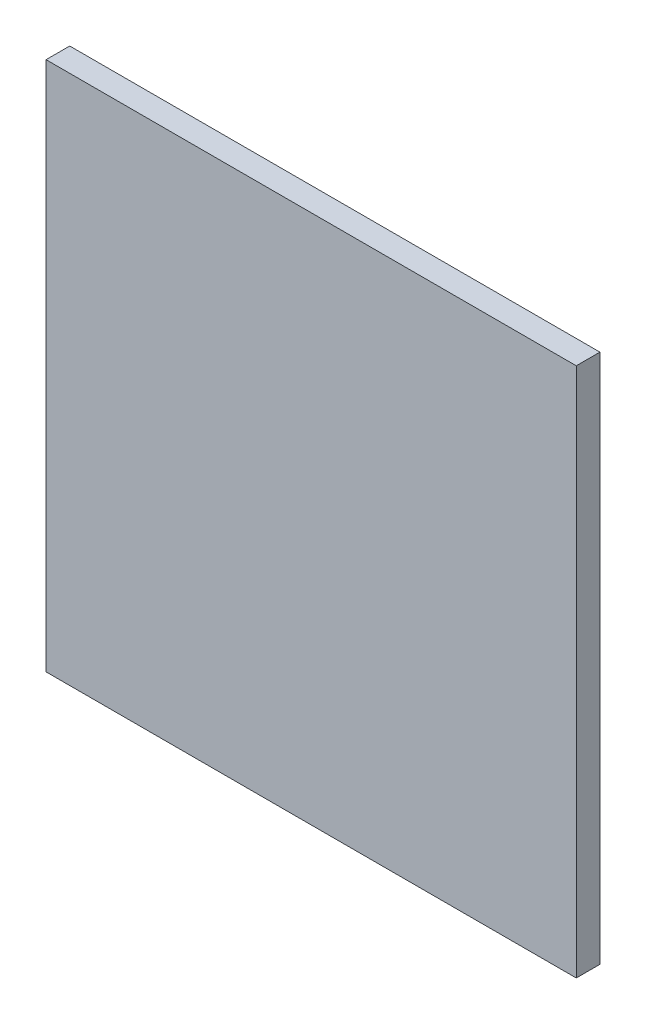
ISO-10303-21;
HEADER;
FILE_DESCRIPTION(('STEP AP214'),'2;1');
FILE_NAME('part.step','',(''),(''),'','','');
FILE_SCHEMA(('AUTOMOTIVE_DESIGN { 1 0 10303 214 1 1 1 1 }'));
ENDSEC;
DATA;
#1=APPLICATION_CONTEXT('core data for automotive mechanical design processes');
#2=APPLICATION_PROTOCOL_DEFINITION('international standard','automotive_design',2000,#1);
#3=PRODUCT_CONTEXT('',#1,'mechanical');
#4=PRODUCT('Part','Part','',(#3));
#5=PRODUCT_RELATED_PRODUCT_CATEGORY('part','',(#4));
#6=PRODUCT_DEFINITION_FORMATION('','',#4);
#7=PRODUCT_DEFINITION_CONTEXT('part definition',#1,'design');
#8=PRODUCT_DEFINITION('design','',#6,#7);
#9=PRODUCT_DEFINITION_SHAPE('','',#8);
#10=(LENGTH_UNIT() NAMED_UNIT(*) SI_UNIT(.MILLI.,.METRE.));
#11=(NAMED_UNIT(*) PLANE_ANGLE_UNIT() SI_UNIT($,.RADIAN.));
#12=(NAMED_UNIT(*) SI_UNIT($,.STERADIAN.) SOLID_ANGLE_UNIT());
#13=UNCERTAINTY_MEASURE_WITH_UNIT(LENGTH_MEASURE(1.E-05),#10,'distance_accuracy_value','');
#14=(GEOMETRIC_REPRESENTATION_CONTEXT(3) GLOBAL_UNCERTAINTY_ASSIGNED_CONTEXT((#13)) GLOBAL_UNIT_ASSIGNED_CONTEXT((#10,
#11,#12)) REPRESENTATION_CONTEXT('',''));
#15=CARTESIAN_POINT('',(0.,0.,0.));
#16=DIRECTION('',(0.,0.,1.));
#17=DIRECTION('',(1.,0.,0.));
#18=AXIS2_PLACEMENT_3D('',#15,#16,#17);
#19=CARTESIAN_POINT('',(-86.3940939597315,43.0777181208054,3.175));
#20=DIRECTION('',(1.,0.,0.));
#21=DIRECTION('',(0.,1.,0.));
#22=AXIS2_PLACEMENT_3D('',#19,#20,#21);
#23=PLANE('',#22);
#24=DIRECTION('',(0.,-1.,0.));
#25=VECTOR('',#24,1.);
#26=CARTESIAN_POINT('',(-86.3940939597315,43.0777181208054,0.));
#27=LINE('',#26,#25);
#28=CARTESIAN_POINT('',(-86.3940939597315,43.0777181208054,0.));
#29=VERTEX_POINT('',#28);
#30=CARTESIAN_POINT('',(-86.3940939597315,-28.0422818791947,0.));
#31=VERTEX_POINT('',#30);
#32=EDGE_CURVE('E96',#29,#31,#27,.T.);
#33=ORIENTED_EDGE('',*,*,#32,.T.);
#34=DIRECTION('',(0.,0.,-1.));
#35=VECTOR('',#34,1.);
#36=CARTESIAN_POINT('',(-86.3940939597315,-28.0422818791947,3.175));
#37=LINE('',#36,#35);
#38=CARTESIAN_POINT('',(-86.3940939597315,-28.0422818791947,3.175));
#39=VERTEX_POINT('',#38);
#40=EDGE_CURVE('E11',#39,#31,#37,.T.);
#41=ORIENTED_EDGE('',*,*,#40,.F.);
#42=DIRECTION('',(0.,-1.,0.));
#43=VECTOR('',#42,1.);
#44=CARTESIAN_POINT('',(-86.3940939597315,43.0777181208054,3.175));
#45=LINE('',#44,#43);
#46=CARTESIAN_POINT('',(-86.3940939597315,43.0777181208054,3.175));
#47=VERTEX_POINT('',#46);
#48=EDGE_CURVE('E82',#47,#39,#45,.T.);
#49=ORIENTED_EDGE('',*,*,#48,.F.);
#50=DIRECTION('',(0.,0.,-1.));
#51=VECTOR('',#50,1.);
#52=CARTESIAN_POINT('',(-86.3940939597315,43.0777181208054,3.175));
#53=LINE('',#52,#51);
#54=EDGE_CURVE('E49',#47,#29,#53,.T.);
#55=ORIENTED_EDGE('',*,*,#54,.T.);
#56=EDGE_LOOP('',(#33,#41,#49,#55));
#57=FACE_BOUND('',#56,.T.);
#58=ADVANCED_FACE('F33',(#57),#23,.F.);
#59=CARTESIAN_POINT('',(-86.3940939597315,-28.0422818791947,3.175));
#60=DIRECTION('',(0.,1.,0.));
#61=DIRECTION('',(0.,0.,1.));
#62=AXIS2_PLACEMENT_3D('',#59,#60,#61);
#63=PLANE('',#62);
#64=DIRECTION('',(1.,0.,0.));
#65=VECTOR('',#64,1.);
#66=CARTESIAN_POINT('',(-86.3940939597315,-28.0422818791947,0.));
#67=LINE('',#66,#65);
#68=CARTESIAN_POINT('',(-15.2740939597315,-28.0422818791947,0.));
#69=VERTEX_POINT('',#68);
#70=EDGE_CURVE('E87',#31,#69,#67,.T.);
#71=ORIENTED_EDGE('',*,*,#70,.T.);
#72=DIRECTION('',(0.,0.,-1.));
#73=VECTOR('',#72,1.);
#74=CARTESIAN_POINT('',(-15.2740939597315,-28.0422818791947,3.175));
#75=LINE('',#74,#73);
#76=CARTESIAN_POINT('',(-15.2740939597315,-28.0422818791947,3.175));
#77=VERTEX_POINT('',#76);
#78=EDGE_CURVE('E41',#77,#69,#75,.T.);
#79=ORIENTED_EDGE('',*,*,#78,.F.);
#80=DIRECTION('',(1.,0.,0.));
#81=VECTOR('',#80,1.);
#82=CARTESIAN_POINT('',(-86.3940939597315,-28.0422818791947,3.175));
#83=LINE('',#82,#81);
#84=EDGE_CURVE('E74',#39,#77,#83,.T.);
#85=ORIENTED_EDGE('',*,*,#84,.F.);
#86=ORIENTED_EDGE('',*,*,#40,.T.);
#87=EDGE_LOOP('',(#71,#79,#85,#86));
#88=FACE_BOUND('',#87,.T.);
#89=ADVANCED_FACE('F86',(#88),#63,.F.);
#90=CARTESIAN_POINT('',(-15.2740939597315,43.0777181208054,3.175));
#91=DIRECTION('',(1.,0.,0.));
#92=DIRECTION('',(0.,1.,0.));
#93=AXIS2_PLACEMENT_3D('',#90,#91,#92);
#94=PLANE('',#93);
#95=DIRECTION('',(0.,-1.,0.));
#96=VECTOR('',#95,1.);
#97=CARTESIAN_POINT('',(-15.2740939597315,43.0777181208054,0.));
#98=LINE('',#97,#96);
#99=CARTESIAN_POINT('',(-15.2740939597315,43.0777181208054,0.));
#100=VERTEX_POINT('',#99);
#101=EDGE_CURVE('E99',#100,#69,#98,.T.);
#102=ORIENTED_EDGE('',*,*,#101,.F.);
#103=DIRECTION('',(0.,0.,-1.));
#104=VECTOR('',#103,1.);
#105=CARTESIAN_POINT('',(-15.2740939597315,43.0777181208054,3.175));
#106=LINE('',#105,#104);
#107=CARTESIAN_POINT('',(-15.2740939597315,43.0777181208054,3.175));
#108=VERTEX_POINT('',#107);
#109=EDGE_CURVE('E63',#108,#100,#106,.T.);
#110=ORIENTED_EDGE('',*,*,#109,.F.);
#111=DIRECTION('',(0.,-1.,0.));
#112=VECTOR('',#111,1.);
#113=CARTESIAN_POINT('',(-15.2740939597315,43.0777181208054,3.175));
#114=LINE('',#113,#112);
#115=EDGE_CURVE('E81',#108,#77,#114,.T.);
#116=ORIENTED_EDGE('',*,*,#115,.T.);
#117=ORIENTED_EDGE('',*,*,#78,.T.);
#118=EDGE_LOOP('',(#102,#110,#116,#117));
#119=FACE_BOUND('',#118,.T.);
#120=ADVANCED_FACE('F90',(#119),#94,.T.);
#121=CARTESIAN_POINT('',(-86.3940939597315,43.0777181208054,3.175));
#122=DIRECTION('',(0.,1.,0.));
#123=DIRECTION('',(0.,0.,1.));
#124=AXIS2_PLACEMENT_3D('',#121,#122,#123);
#125=PLANE('',#124);
#126=DIRECTION('',(1.,0.,0.));
#127=VECTOR('',#126,1.);
#128=CARTESIAN_POINT('',(-86.3940939597315,43.0777181208054,0.));
#129=LINE('',#128,#127);
#130=EDGE_CURVE('E101',#29,#100,#129,.T.);
#131=ORIENTED_EDGE('',*,*,#130,.F.);
#132=ORIENTED_EDGE('',*,*,#54,.F.);
#133=DIRECTION('',(1.,0.,0.));
#134=VECTOR('',#133,1.);
#135=CARTESIAN_POINT('',(-86.3940939597315,43.0777181208054,3.175));
#136=LINE('',#135,#134);
#137=EDGE_CURVE('E91',#47,#108,#136,.T.);
#138=ORIENTED_EDGE('',*,*,#137,.T.);
#139=ORIENTED_EDGE('',*,*,#109,.T.);
#140=EDGE_LOOP('',(#131,#132,#138,#139));
#141=FACE_BOUND('',#140,.T.);
#142=ADVANCED_FACE('F107',(#141),#125,.T.);
#143=CARTESIAN_POINT('',(0.,0.,3.175));
#144=DIRECTION('',(0.,0.,1.));
#145=DIRECTION('',(1.,0.,0.));
#146=AXIS2_PLACEMENT_3D('',#143,#144,#145);
#147=PLANE('',#146);
#148=ORIENTED_EDGE('',*,*,#48,.T.);
#149=ORIENTED_EDGE('',*,*,#84,.T.);
#150=ORIENTED_EDGE('',*,*,#115,.F.);
#151=ORIENTED_EDGE('',*,*,#137,.F.);
#152=EDGE_LOOP('',(#148,#149,#150,#151));
#153=FACE_BOUND('',#152,.T.);
#154=ADVANCED_FACE('F78',(#153),#147,.T.);
#155=CARTESIAN_POINT('',(0.,0.,0.));
#156=DIRECTION('',(0.,0.,1.));
#157=DIRECTION('',(1.,0.,0.));
#158=AXIS2_PLACEMENT_3D('',#155,#156,#157);
#159=PLANE('',#158);
#160=ORIENTED_EDGE('',*,*,#32,.F.);
#161=ORIENTED_EDGE('',*,*,#130,.T.);
#162=ORIENTED_EDGE('',*,*,#101,.T.);
#163=ORIENTED_EDGE('',*,*,#70,.F.);
#164=EDGE_LOOP('',(#160,#161,#162,#163));
#165=FACE_BOUND('',#164,.T.);
#166=ADVANCED_FACE('F106',(#165),#159,.F.);
#167=CLOSED_SHELL('',(#58,#89,#120,#142,#154,#166));
#168=MANIFOLD_SOLID_BREP('B2',#167);
#169=ADVANCED_BREP_SHAPE_REPRESENTATION('',(#18,#168),#14);
#170=SHAPE_DEFINITION_REPRESENTATION(#9,#169);
ENDSEC;
END-ISO-10303-21;
